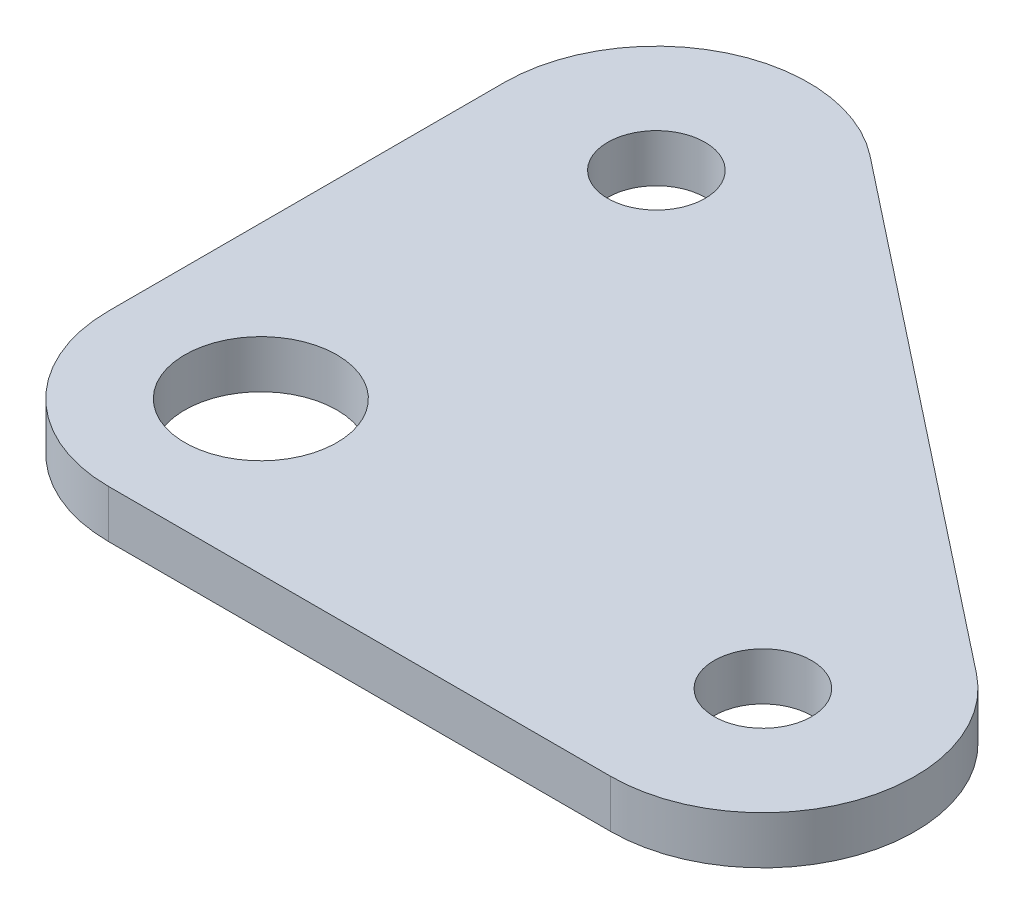
ISO-10303-21;
HEADER;
FILE_DESCRIPTION(('STEP AP214'),'2;1');
FILE_NAME('part.step','',(''),(''),'','','');
FILE_SCHEMA(('AUTOMOTIVE_DESIGN { 1 0 10303 214 1 1 1 1 }'));
ENDSEC;
DATA;
#1=APPLICATION_CONTEXT('core data for automotive mechanical design processes');
#2=APPLICATION_PROTOCOL_DEFINITION('international standard','automotive_design',2000,#1);
#3=PRODUCT_CONTEXT('',#1,'mechanical');
#4=PRODUCT('Part','Part','',(#3));
#5=PRODUCT_RELATED_PRODUCT_CATEGORY('part','',(#4));
#6=PRODUCT_DEFINITION_FORMATION('','',#4);
#7=PRODUCT_DEFINITION_CONTEXT('part definition',#1,'design');
#8=PRODUCT_DEFINITION('design','',#6,#7);
#9=PRODUCT_DEFINITION_SHAPE('','',#8);
#10=(LENGTH_UNIT() NAMED_UNIT(*) SI_UNIT(.MILLI.,.METRE.));
#11=(NAMED_UNIT(*) PLANE_ANGLE_UNIT() SI_UNIT($,.RADIAN.));
#12=(NAMED_UNIT(*) SI_UNIT($,.STERADIAN.) SOLID_ANGLE_UNIT());
#13=UNCERTAINTY_MEASURE_WITH_UNIT(LENGTH_MEASURE(1.E-05),#10,'distance_accuracy_value','');
#14=(GEOMETRIC_REPRESENTATION_CONTEXT(3) GLOBAL_UNCERTAINTY_ASSIGNED_CONTEXT((#13)) GLOBAL_UNIT_ASSIGNED_CONTEXT((#10,
#11,#12)) REPRESENTATION_CONTEXT('',''));
#15=CARTESIAN_POINT('',(0.,0.,0.));
#16=DIRECTION('',(0.,0.,1.));
#17=DIRECTION('',(1.,0.,0.));
#18=AXIS2_PLACEMENT_3D('',#15,#16,#17);
#19=CARTESIAN_POINT('',(0.,0.,0.));
#20=DIRECTION('',(0.,1.,0.));
#21=DIRECTION('',(0.,0.,1.));
#22=AXIS2_PLACEMENT_3D('',#19,#20,#21);
#23=CYLINDRICAL_SURFACE('',#22,5.);
#24=CARTESIAN_POINT('',(0.,1.56999999999996,0.));
#25=DIRECTION('',(0.,1.,0.));
#26=DIRECTION('',(0.,0.,1.));
#27=AXIS2_PLACEMENT_3D('',#24,#25,#26);
#28=CIRCLE('',#27,5.);
#29=CARTESIAN_POINT('',(-5.,1.56999999999996,0.));
#30=VERTEX_POINT('',#29);
#31=CARTESIAN_POINT('',(0.,1.56999999999996,5.));
#32=VERTEX_POINT('',#31);
#33=EDGE_CURVE('E142',#30,#32,#28,.T.);
#34=ORIENTED_EDGE('',*,*,#33,.F.);
#35=DIRECTION('',(0.,1.,0.));
#36=VECTOR('',#35,1.);
#37=CARTESIAN_POINT('',(-5.,0.,0.));
#38=LINE('',#37,#36);
#39=CARTESIAN_POINT('',(-5.,0.,0.));
#40=VERTEX_POINT('',#39);
#41=EDGE_CURVE('E11',#40,#30,#38,.T.);
#42=ORIENTED_EDGE('',*,*,#41,.F.);
#43=CARTESIAN_POINT('',(0.,0.,0.));
#44=DIRECTION('',(0.,1.,0.));
#45=DIRECTION('',(0.,0.,1.));
#46=AXIS2_PLACEMENT_3D('',#43,#44,#45);
#47=CIRCLE('',#46,5.);
#48=CARTESIAN_POINT('',(0.,0.,5.));
#49=VERTEX_POINT('',#48);
#50=EDGE_CURVE('E162',#40,#49,#47,.T.);
#51=ORIENTED_EDGE('',*,*,#50,.T.);
#52=DIRECTION('',(0.,1.,0.));
#53=VECTOR('',#52,1.);
#54=CARTESIAN_POINT('',(0.,0.,5.));
#55=LINE('',#54,#53);
#56=EDGE_CURVE('E41',#49,#32,#55,.T.);
#57=ORIENTED_EDGE('',*,*,#56,.T.);
#58=EDGE_LOOP('',(#34,#42,#51,#57));
#59=FACE_BOUND('',#58,.T.);
#60=ADVANCED_FACE('F38',(#59),#23,.T.);
#61=CARTESIAN_POINT('',(-5.,0.,-13.));
#62=DIRECTION('',(-1.,0.,0.));
#63=DIRECTION('',(0.,0.,1.));
#64=AXIS2_PLACEMENT_3D('',#61,#62,#63);
#65=PLANE('',#64);
#66=DIRECTION('',(0.,0.,1.));
#67=VECTOR('',#66,1.);
#68=CARTESIAN_POINT('',(-5.,1.56999999999996,-13.));
#69=LINE('',#68,#67);
#70=CARTESIAN_POINT('',(-5.00000000000001,1.56999999999996,-13.));
#71=VERTEX_POINT('',#70);
#72=EDGE_CURVE('E159',#71,#30,#69,.T.);
#73=ORIENTED_EDGE('',*,*,#72,.F.);
#74=DIRECTION('',(0.,1.,0.));
#75=VECTOR('',#74,1.);
#76=CARTESIAN_POINT('',(-5.00000000000001,0.,-13.));
#77=LINE('',#76,#75);
#78=CARTESIAN_POINT('',(-5.00000000000001,0.,-13.));
#79=VERTEX_POINT('',#78);
#80=EDGE_CURVE('E48',#79,#71,#77,.T.);
#81=ORIENTED_EDGE('',*,*,#80,.F.);
#82=DIRECTION('',(0.,0.,1.));
#83=VECTOR('',#82,1.);
#84=CARTESIAN_POINT('',(-5.,0.,-13.));
#85=LINE('',#84,#83);
#86=EDGE_CURVE('E127',#79,#40,#85,.T.);
#87=ORIENTED_EDGE('',*,*,#86,.T.);
#88=ORIENTED_EDGE('',*,*,#41,.T.);
#89=EDGE_LOOP('',(#73,#81,#87,#88));
#90=FACE_BOUND('',#89,.T.);
#91=ADVANCED_FACE('F175',(#90),#65,.T.);
#92=CARTESIAN_POINT('',(0.,0.,-13.));
#93=DIRECTION('',(0.,1.,0.));
#94=DIRECTION('',(0.,0.,1.));
#95=AXIS2_PLACEMENT_3D('',#92,#93,#94);
#96=CYLINDRICAL_SURFACE('',#95,5.00000000000001);
#97=CARTESIAN_POINT('',(0.,1.56999999999996,-13.));
#98=DIRECTION('',(0.,1.,0.));
#99=DIRECTION('',(0.,0.,1.));
#100=AXIS2_PLACEMENT_3D('',#97,#98,#99);
#101=CIRCLE('',#100,5.00000000000001);
#102=CARTESIAN_POINT('',(3.09436113301758,1.56999999999996,-16.9274583611377));
#103=VERTEX_POINT('',#102);
#104=EDGE_CURVE('E113',#103,#71,#101,.T.);
#105=ORIENTED_EDGE('',*,*,#104,.F.);
#106=DIRECTION('',(0.,1.,0.));
#107=VECTOR('',#106,1.);
#108=CARTESIAN_POINT('',(3.09436113301758,0.,-16.9274583611377));
#109=LINE('',#108,#107);
#110=CARTESIAN_POINT('',(3.09436113301758,0.,-16.9274583611377));
#111=VERTEX_POINT('',#110);
#112=EDGE_CURVE('E108',#111,#103,#109,.T.);
#113=ORIENTED_EDGE('',*,*,#112,.F.);
#114=CARTESIAN_POINT('',(0.,0.,-13.));
#115=DIRECTION('',(0.,1.,0.));
#116=DIRECTION('',(0.,0.,1.));
#117=AXIS2_PLACEMENT_3D('',#114,#115,#116);
#118=CIRCLE('',#117,5.00000000000001);
#119=EDGE_CURVE('E111',#111,#79,#118,.T.);
#120=ORIENTED_EDGE('',*,*,#119,.T.);
#121=ORIENTED_EDGE('',*,*,#80,.T.);
#122=EDGE_LOOP('',(#105,#113,#120,#121));
#123=FACE_BOUND('',#122,.T.);
#124=ADVANCED_FACE('F110',(#123),#96,.T.);
#125=CARTESIAN_POINT('',(19.5943611330177,0.,-3.92745836113766));
#126=DIRECTION('',(0.618872226603512,0.,-0.785491672227536));
#127=DIRECTION('',(-0.785491672227536,0.,-0.618872226603512));
#128=AXIS2_PLACEMENT_3D('',#125,#126,#127);
#129=PLANE('',#128);
#130=DIRECTION('',(-0.785491672227536,0.,-0.618872226603512));
#131=VECTOR('',#130,1.);
#132=CARTESIAN_POINT('',(19.5943611330177,1.56999999999996,-3.92745836113766));
#133=LINE('',#132,#131);
#134=CARTESIAN_POINT('',(19.5943611330177,1.56999999999996,-3.92745836113767));
#135=VERTEX_POINT('',#134);
#136=EDGE_CURVE('E155',#135,#103,#133,.T.);
#137=ORIENTED_EDGE('',*,*,#136,.F.);
#138=DIRECTION('',(0.,1.,0.));
#139=VECTOR('',#138,1.);
#140=CARTESIAN_POINT('',(19.5943611330177,0.,-3.92745836113767));
#141=LINE('',#140,#139);
#142=CARTESIAN_POINT('',(19.5943611330177,0.,-3.92745836113767));
#143=VERTEX_POINT('',#142);
#144=EDGE_CURVE('E119',#143,#135,#141,.T.);
#145=ORIENTED_EDGE('',*,*,#144,.F.);
#146=DIRECTION('',(-0.785491672227536,0.,-0.618872226603512));
#147=VECTOR('',#146,1.);
#148=CARTESIAN_POINT('',(19.5943611330177,0.,-3.92745836113766));
#149=LINE('',#148,#147);
#150=EDGE_CURVE('E125',#143,#111,#149,.T.);
#151=ORIENTED_EDGE('',*,*,#150,.T.);
#152=ORIENTED_EDGE('',*,*,#112,.T.);
#153=EDGE_LOOP('',(#137,#145,#151,#152));
#154=FACE_BOUND('',#153,.T.);
#155=ADVANCED_FACE('F130',(#154),#129,.T.);
#156=CARTESIAN_POINT('',(16.5000000000001,0.,0.));
#157=DIRECTION('',(0.,1.,0.));
#158=DIRECTION('',(0.,0.,1.));
#159=AXIS2_PLACEMENT_3D('',#156,#157,#158);
#160=CYLINDRICAL_SURFACE('',#159,4.99999999999999);
#161=CARTESIAN_POINT('',(16.5000000000001,1.56999999999996,0.));
#162=DIRECTION('',(0.,1.,0.));
#163=DIRECTION('',(0.,0.,1.));
#164=AXIS2_PLACEMENT_3D('',#161,#162,#163);
#165=CIRCLE('',#164,4.99999999999999);
#166=CARTESIAN_POINT('',(16.5000000000001,1.56999999999996,5.));
#167=VERTEX_POINT('',#166);
#168=EDGE_CURVE('E151',#167,#135,#165,.T.);
#169=ORIENTED_EDGE('',*,*,#168,.F.);
#170=DIRECTION('',(0.,1.,0.));
#171=VECTOR('',#170,1.);
#172=CARTESIAN_POINT('',(16.5000000000001,0.,5.));
#173=LINE('',#172,#171);
#174=CARTESIAN_POINT('',(16.5000000000001,0.,5.));
#175=VERTEX_POINT('',#174);
#176=EDGE_CURVE('E167',#175,#167,#173,.T.);
#177=ORIENTED_EDGE('',*,*,#176,.F.);
#178=CARTESIAN_POINT('',(16.5000000000001,0.,0.));
#179=DIRECTION('',(0.,1.,0.));
#180=DIRECTION('',(0.,0.,1.));
#181=AXIS2_PLACEMENT_3D('',#178,#179,#180);
#182=CIRCLE('',#181,4.99999999999999);
#183=EDGE_CURVE('E132',#175,#143,#182,.T.);
#184=ORIENTED_EDGE('',*,*,#183,.T.);
#185=ORIENTED_EDGE('',*,*,#144,.T.);
#186=EDGE_LOOP('',(#169,#177,#184,#185));
#187=FACE_BOUND('',#186,.T.);
#188=ADVANCED_FACE('F188',(#187),#160,.T.);
#189=CARTESIAN_POINT('',(0.,0.,5.));
#190=DIRECTION('',(0.,0.,1.));
#191=DIRECTION('',(1.,0.,0.));
#192=AXIS2_PLACEMENT_3D('',#189,#190,#191);
#193=PLANE('',#192);
#194=DIRECTION('',(1.,0.,0.));
#195=VECTOR('',#194,1.);
#196=CARTESIAN_POINT('',(0.,1.56999999999996,5.));
#197=LINE('',#196,#195);
#198=EDGE_CURVE('E146',#32,#167,#197,.T.);
#199=ORIENTED_EDGE('',*,*,#198,.F.);
#200=ORIENTED_EDGE('',*,*,#56,.F.);
#201=DIRECTION('',(1.,0.,0.));
#202=VECTOR('',#201,1.);
#203=CARTESIAN_POINT('',(0.,0.,5.));
#204=LINE('',#203,#202);
#205=EDGE_CURVE('E136',#49,#175,#204,.T.);
#206=ORIENTED_EDGE('',*,*,#205,.T.);
#207=ORIENTED_EDGE('',*,*,#176,.T.);
#208=EDGE_LOOP('',(#199,#200,#206,#207));
#209=FACE_BOUND('',#208,.T.);
#210=ADVANCED_FACE('F172',(#209),#193,.T.);
#211=CARTESIAN_POINT('',(0.,0.,0.));
#212=DIRECTION('',(0.,1.,0.));
#213=DIRECTION('',(0.,0.,1.));
#214=AXIS2_PLACEMENT_3D('',#211,#212,#213);
#215=PLANE('',#214);
#216=CARTESIAN_POINT('',(0.,0.,0.));
#217=DIRECTION('',(0.,1.,0.));
#218=DIRECTION('',(0.,0.,-1.));
#219=AXIS2_PLACEMENT_3D('',#216,#217,#218);
#220=CIRCLE('',#219,2.5);
#221=CARTESIAN_POINT('',(0.,0.,-2.5));
#222=VERTEX_POINT('',#221);
#223=EDGE_CURVE('E218',#222,#222,#220,.T.);
#224=ORIENTED_EDGE('',*,*,#223,.T.);
#225=EDGE_LOOP('',(#224));
#226=FACE_BOUND('',#225,.T.);
#227=CARTESIAN_POINT('',(16.5000000000001,0.,0.));
#228=DIRECTION('',(0.,1.,0.));
#229=DIRECTION('',(0.,0.,-1.));
#230=AXIS2_PLACEMENT_3D('',#227,#228,#229);
#231=CIRCLE('',#230,1.6);
#232=CARTESIAN_POINT('',(16.5000000000001,0.,-1.6));
#233=VERTEX_POINT('',#232);
#234=EDGE_CURVE('E228',#233,#233,#231,.T.);
#235=ORIENTED_EDGE('',*,*,#234,.T.);
#236=EDGE_LOOP('',(#235));
#237=FACE_BOUND('',#236,.T.);
#238=CARTESIAN_POINT('',(0.,0.,-13.));
#239=DIRECTION('',(0.,1.,0.));
#240=DIRECTION('',(0.,0.,-1.));
#241=AXIS2_PLACEMENT_3D('',#238,#239,#240);
#242=CIRCLE('',#241,1.6);
#243=CARTESIAN_POINT('',(0.,0.,-14.6));
#244=VERTEX_POINT('',#243);
#245=EDGE_CURVE('E147',#244,#244,#242,.T.);
#246=ORIENTED_EDGE('',*,*,#245,.T.);
#247=EDGE_LOOP('',(#246));
#248=FACE_BOUND('',#247,.T.);
#249=ORIENTED_EDGE('',*,*,#50,.F.);
#250=ORIENTED_EDGE('',*,*,#86,.F.);
#251=ORIENTED_EDGE('',*,*,#119,.F.);
#252=ORIENTED_EDGE('',*,*,#150,.F.);
#253=ORIENTED_EDGE('',*,*,#183,.F.);
#254=ORIENTED_EDGE('',*,*,#205,.F.);
#255=EDGE_LOOP('',(#249,#250,#251,#252,#253,#254));
#256=FACE_BOUND('',#255,.T.);
#257=ADVANCED_FACE('F123',(#226,#237,#248,#256),#215,.F.);
#258=CARTESIAN_POINT('',(0.,1.56999999999996,0.));
#259=DIRECTION('',(0.,1.,0.));
#260=DIRECTION('',(0.,0.,1.));
#261=AXIS2_PLACEMENT_3D('',#258,#259,#260);
#262=PLANE('',#261);
#263=CARTESIAN_POINT('',(0.,1.56999999999996,0.));
#264=DIRECTION('',(0.,1.,0.));
#265=DIRECTION('',(0.,0.,-1.));
#266=AXIS2_PLACEMENT_3D('',#263,#264,#265);
#267=CIRCLE('',#266,2.5);
#268=CARTESIAN_POINT('',(0.,1.56999999999996,-2.5));
#269=VERTEX_POINT('',#268);
#270=EDGE_CURVE('E221',#269,#269,#267,.T.);
#271=ORIENTED_EDGE('',*,*,#270,.F.);
#272=EDGE_LOOP('',(#271));
#273=FACE_BOUND('',#272,.T.);
#274=CARTESIAN_POINT('',(16.5000000000001,1.56999999999996,0.));
#275=DIRECTION('',(0.,1.,0.));
#276=DIRECTION('',(0.,0.,-1.));
#277=AXIS2_PLACEMENT_3D('',#274,#275,#276);
#278=CIRCLE('',#277,1.6);
#279=CARTESIAN_POINT('',(16.5000000000001,1.56999999999996,-1.6));
#280=VERTEX_POINT('',#279);
#281=EDGE_CURVE('E225',#280,#280,#278,.T.);
#282=ORIENTED_EDGE('',*,*,#281,.F.);
#283=EDGE_LOOP('',(#282));
#284=FACE_BOUND('',#283,.T.);
#285=CARTESIAN_POINT('',(0.,1.56999999999996,-13.));
#286=DIRECTION('',(0.,1.,0.));
#287=DIRECTION('',(0.,0.,-1.));
#288=AXIS2_PLACEMENT_3D('',#285,#286,#287);
#289=CIRCLE('',#288,1.6);
#290=CARTESIAN_POINT('',(0.,1.56999999999996,-14.6));
#291=VERTEX_POINT('',#290);
#292=EDGE_CURVE('E232',#291,#291,#289,.T.);
#293=ORIENTED_EDGE('',*,*,#292,.F.);
#294=EDGE_LOOP('',(#293));
#295=FACE_BOUND('',#294,.T.);
#296=ORIENTED_EDGE('',*,*,#33,.T.);
#297=ORIENTED_EDGE('',*,*,#198,.T.);
#298=ORIENTED_EDGE('',*,*,#168,.T.);
#299=ORIENTED_EDGE('',*,*,#136,.T.);
#300=ORIENTED_EDGE('',*,*,#104,.T.);
#301=ORIENTED_EDGE('',*,*,#72,.T.);
#302=EDGE_LOOP('',(#296,#297,#298,#299,#300,#301));
#303=FACE_BOUND('',#302,.T.);
#304=ADVANCED_FACE('F174',(#273,#284,#295,#303),#262,.T.);
#305=CARTESIAN_POINT('',(0.,0.,-13.));
#306=DIRECTION('',(0.,1.,0.));
#307=DIRECTION('',(0.,0.,1.));
#308=AXIS2_PLACEMENT_3D('',#305,#306,#307);
#309=CYLINDRICAL_SURFACE('',#308,1.6);
#310=ORIENTED_EDGE('',*,*,#245,.F.);
#311=EDGE_LOOP('',(#310));
#312=FACE_BOUND('',#311,.T.);
#313=ORIENTED_EDGE('',*,*,#292,.T.);
#314=EDGE_LOOP('',(#313));
#315=FACE_BOUND('',#314,.T.);
#316=ADVANCED_FACE('F199',(#312,#315),#309,.F.);
#317=CARTESIAN_POINT('',(16.5000000000001,0.,0.));
#318=DIRECTION('',(0.,1.,0.));
#319=DIRECTION('',(0.,0.,1.));
#320=AXIS2_PLACEMENT_3D('',#317,#318,#319);
#321=CYLINDRICAL_SURFACE('',#320,1.6);
#322=ORIENTED_EDGE('',*,*,#234,.F.);
#323=EDGE_LOOP('',(#322));
#324=FACE_BOUND('',#323,.T.);
#325=ORIENTED_EDGE('',*,*,#281,.T.);
#326=EDGE_LOOP('',(#325));
#327=FACE_BOUND('',#326,.T.);
#328=ADVANCED_FACE('F206',(#324,#327),#321,.F.);
#329=CARTESIAN_POINT('',(0.,0.,0.));
#330=DIRECTION('',(0.,1.,0.));
#331=DIRECTION('',(0.,0.,1.));
#332=AXIS2_PLACEMENT_3D('',#329,#330,#331);
#333=CYLINDRICAL_SURFACE('',#332,2.5);
#334=ORIENTED_EDGE('',*,*,#223,.F.);
#335=EDGE_LOOP('',(#334));
#336=FACE_BOUND('',#335,.T.);
#337=ORIENTED_EDGE('',*,*,#270,.T.);
#338=EDGE_LOOP('',(#337));
#339=FACE_BOUND('',#338,.T.);
#340=ADVANCED_FACE('F210',(#336,#339),#333,.F.);
#341=CLOSED_SHELL('',(#60,#91,#124,#155,#188,#210,#257,#304,#316,#328,#340));
#342=MANIFOLD_SOLID_BREP('B2',#341);
#343=ADVANCED_BREP_SHAPE_REPRESENTATION('',(#18,#342),#14);
#344=SHAPE_DEFINITION_REPRESENTATION(#9,#343);
ENDSEC;
END-ISO-10303-21;
